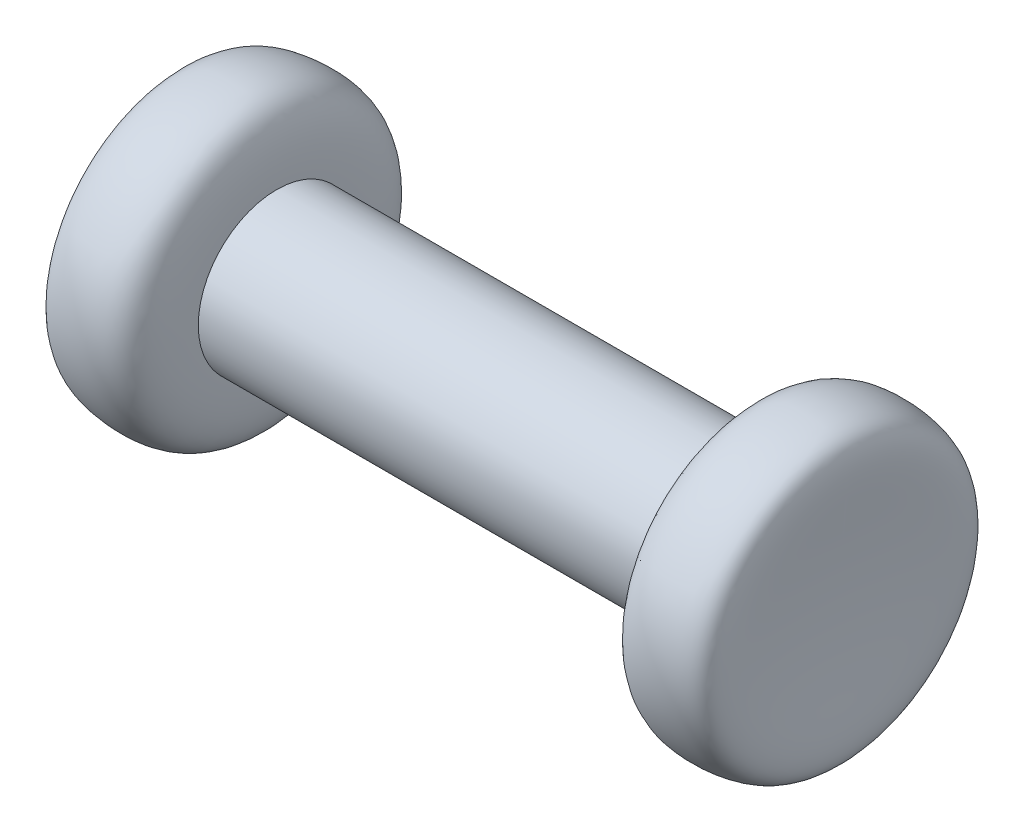
ISO-10303-21;
HEADER;
FILE_DESCRIPTION(('STEP AP214'),'2;1');
FILE_NAME('part.step','',(''),(''),'','','');
FILE_SCHEMA(('AUTOMOTIVE_DESIGN { 1 0 10303 214 1 1 1 1 }'));
ENDSEC;
DATA;
#1=APPLICATION_CONTEXT('core data for automotive mechanical design processes');
#2=APPLICATION_PROTOCOL_DEFINITION('international standard','automotive_design',2000,#1);
#3=PRODUCT_CONTEXT('',#1,'mechanical');
#4=PRODUCT('Part','Part','',(#3));
#5=PRODUCT_RELATED_PRODUCT_CATEGORY('part','',(#4));
#6=PRODUCT_DEFINITION_FORMATION('','',#4);
#7=PRODUCT_DEFINITION_CONTEXT('part definition',#1,'design');
#8=PRODUCT_DEFINITION('design','',#6,#7);
#9=PRODUCT_DEFINITION_SHAPE('','',#8);
#10=(LENGTH_UNIT() NAMED_UNIT(*) SI_UNIT(.MILLI.,.METRE.));
#11=(NAMED_UNIT(*) PLANE_ANGLE_UNIT() SI_UNIT($,.RADIAN.));
#12=(NAMED_UNIT(*) SI_UNIT($,.STERADIAN.) SOLID_ANGLE_UNIT());
#13=UNCERTAINTY_MEASURE_WITH_UNIT(LENGTH_MEASURE(1.E-05),#10,'distance_accuracy_value','');
#14=(GEOMETRIC_REPRESENTATION_CONTEXT(3) GLOBAL_UNCERTAINTY_ASSIGNED_CONTEXT((#13)) GLOBAL_UNIT_ASSIGNED_CONTEXT((#10,
#11,#12)) REPRESENTATION_CONTEXT('',''));
#15=CARTESIAN_POINT('',(0.,0.,0.));
#16=DIRECTION('',(0.,0.,1.));
#17=DIRECTION('',(1.,0.,0.));
#18=AXIS2_PLACEMENT_3D('',#15,#16,#17);
#19=CARTESIAN_POINT('',(-7.5,0.,0.));
#20=CARTESIAN_POINT('',(-7.5,1.21258413749267,0.));
#21=CARTESIAN_POINT('',(-7.73274983824572,2.33342520350582,0.));
#22=CARTESIAN_POINT('',(-11.3917170284987,2.19039985023876,0.));
#23=CARTESIAN_POINT('',(-10.5,1.13356463695896,0.));
#24=CARTESIAN_POINT('',(-10.5,-2.5,0.));
#25=B_SPLINE_CURVE_WITH_KNOTS('',3,(#19,#20,#21,#22,#23,#24),.UNSPECIFIED.,.F.,.F.,(4,1,1,4),
(0.,0.265537356272805,0.444563775254335,1.),.UNSPECIFIED.);
#26=CARTESIAN_POINT('',(-10.5,-2.5,0.));
#27=DIRECTION('',(-1.,0.,0.));
#28=AXIS1_PLACEMENT('',#26,#27);
#29=SURFACE_OF_REVOLUTION('',#25,#28);
#30=CARTESIAN_POINT('',(-10.5,-2.5,0.));
#31=VERTEX_POINT('',#30);
#32=VERTEX_LOOP('',#31);
#33=FACE_BOUND('',#32,.T.);
#34=CARTESIAN_POINT('',(-7.5,-2.5,0.));
#35=DIRECTION('',(-1.,0.,0.));
#36=DIRECTION('',(0.,0.,1.));
#37=AXIS2_PLACEMENT_3D('',#34,#35,#36);
#38=CIRCLE('',#37,2.5);
#39=CARTESIAN_POINT('',(-7.5,-2.5,2.5));
#40=VERTEX_POINT('',#39);
#41=EDGE_CURVE('E11',#40,#40,#38,.T.);
#42=ORIENTED_EDGE('',*,*,#41,.T.);
#43=EDGE_LOOP('',(#42));
#44=FACE_BOUND('',#43,.T.);
#45=ADVANCED_FACE('F42',(#33,#44),#29,.T.);
#46=CARTESIAN_POINT('',(-10.5,-2.5,0.));
#47=DIRECTION('',(-1.,0.,0.));
#48=DIRECTION('',(0.,0.,1.));
#49=AXIS2_PLACEMENT_3D('',#46,#47,#48);
#50=CYLINDRICAL_SURFACE('',#49,2.5);
#51=ORIENTED_EDGE('',*,*,#41,.F.);
#52=EDGE_LOOP('',(#51));
#53=FACE_BOUND('',#52,.T.);
#54=CARTESIAN_POINT('',(7.5,-2.5,0.));
#55=DIRECTION('',(-1.,0.,0.));
#56=DIRECTION('',(0.,0.,1.));
#57=AXIS2_PLACEMENT_3D('',#54,#55,#56);
#58=CIRCLE('',#57,2.5);
#59=CARTESIAN_POINT('',(7.5,-2.5,2.5));
#60=VERTEX_POINT('',#59);
#61=EDGE_CURVE('E51',#60,#60,#58,.T.);
#62=ORIENTED_EDGE('',*,*,#61,.T.);
#63=EDGE_LOOP('',(#62));
#64=FACE_BOUND('',#63,.T.);
#65=ADVANCED_FACE('F59',(#53,#64),#50,.T.);
#66=CARTESIAN_POINT('',(10.5,-2.5,0.));
#67=CARTESIAN_POINT('',(10.5,1.13356463695896,0.));
#68=CARTESIAN_POINT('',(11.3917170284987,2.19039985023876,0.));
#69=CARTESIAN_POINT('',(7.73274983824573,2.33342520350582,0.));
#70=CARTESIAN_POINT('',(7.5,1.21258413749267,0.));
#71=CARTESIAN_POINT('',(7.5,0.,0.));
#72=B_SPLINE_CURVE_WITH_KNOTS('',3,(#66,#67,#68,#69,#70,#71),.UNSPECIFIED.,.F.,.F.,(4,1,1,4),
(0.,0.555436224745665,0.734462643727195,1.),.UNSPECIFIED.);
#73=CARTESIAN_POINT('',(-10.5,-2.5,0.));
#74=DIRECTION('',(-1.,0.,0.));
#75=AXIS1_PLACEMENT('',#73,#74);
#76=SURFACE_OF_REVOLUTION('',#72,#75);
#77=ORIENTED_EDGE('',*,*,#61,.F.);
#78=EDGE_LOOP('',(#77));
#79=FACE_BOUND('',#78,.T.);
#80=CARTESIAN_POINT('',(10.5,-2.5,0.));
#81=VERTEX_POINT('',#80);
#82=VERTEX_LOOP('',#81);
#83=FACE_BOUND('',#82,.T.);
#84=ADVANCED_FACE('F64',(#79,#83),#76,.T.);
#85=CLOSED_SHELL('',(#45,#65,#84));
#86=MANIFOLD_SOLID_BREP('B2',#85);
#87=ADVANCED_BREP_SHAPE_REPRESENTATION('',(#18,#86),#14);
#88=SHAPE_DEFINITION_REPRESENTATION(#9,#87);
ENDSEC;
END-ISO-10303-21;
